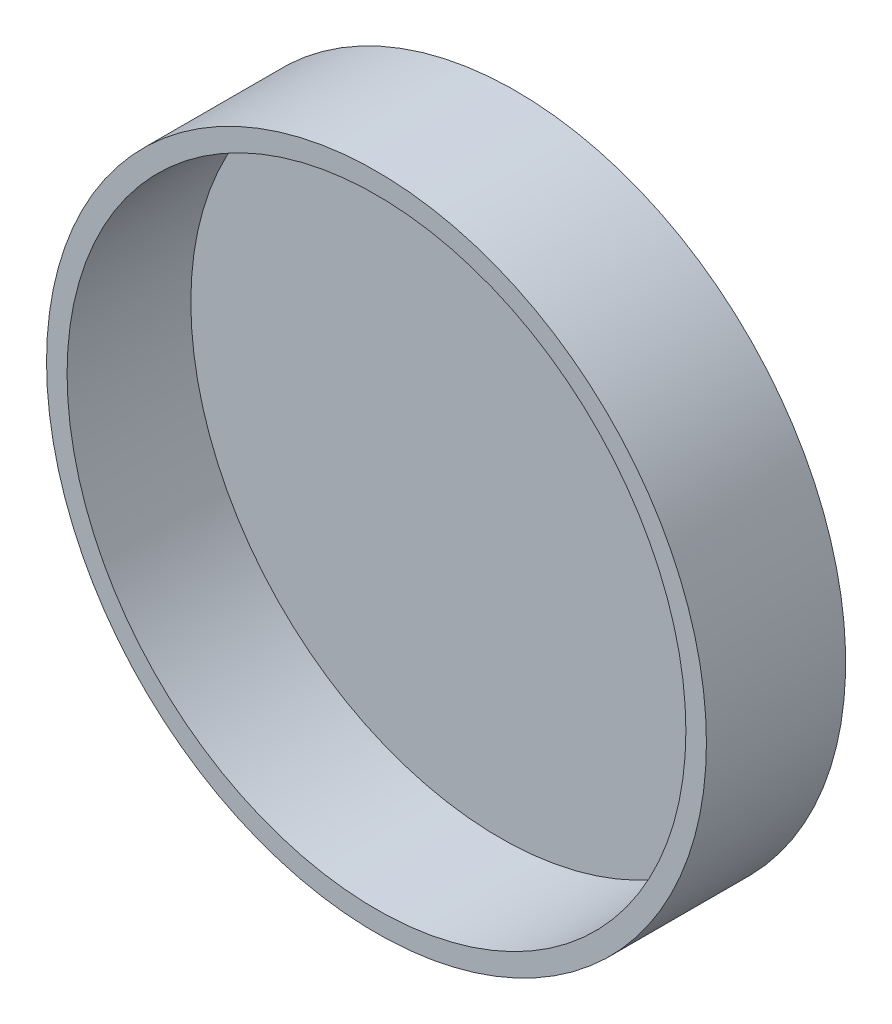
ISO-10303-21;
HEADER;
FILE_DESCRIPTION(('STEP AP214'),'2;1');
FILE_NAME('part.step','',(''),(''),'','','');
FILE_SCHEMA(('AUTOMOTIVE_DESIGN { 1 0 10303 214 1 1 1 1 }'));
ENDSEC;
DATA;
#1=APPLICATION_CONTEXT('core data for automotive mechanical design processes');
#2=APPLICATION_PROTOCOL_DEFINITION('international standard','automotive_design',2000,#1);
#3=PRODUCT_CONTEXT('',#1,'mechanical');
#4=PRODUCT('Part','Part','',(#3));
#5=PRODUCT_RELATED_PRODUCT_CATEGORY('part','',(#4));
#6=PRODUCT_DEFINITION_FORMATION('','',#4);
#7=PRODUCT_DEFINITION_CONTEXT('part definition',#1,'design');
#8=PRODUCT_DEFINITION('design','',#6,#7);
#9=PRODUCT_DEFINITION_SHAPE('','',#8);
#10=(LENGTH_UNIT() NAMED_UNIT(*) SI_UNIT(.MILLI.,.METRE.));
#11=(NAMED_UNIT(*) PLANE_ANGLE_UNIT() SI_UNIT($,.RADIAN.));
#12=(NAMED_UNIT(*) SI_UNIT($,.STERADIAN.) SOLID_ANGLE_UNIT());
#13=UNCERTAINTY_MEASURE_WITH_UNIT(LENGTH_MEASURE(1.E-05),#10,'distance_accuracy_value','');
#14=(GEOMETRIC_REPRESENTATION_CONTEXT(3) GLOBAL_UNCERTAINTY_ASSIGNED_CONTEXT((#13)) GLOBAL_UNIT_ASSIGNED_CONTEXT((#10,
#11,#12)) REPRESENTATION_CONTEXT('',''));
#15=CARTESIAN_POINT('',(0.,0.,0.));
#16=DIRECTION('',(0.,0.,1.));
#17=DIRECTION('',(1.,0.,0.));
#18=AXIS2_PLACEMENT_3D('',#15,#16,#17);
#19=CARTESIAN_POINT('',(-33.8331221152249,23.9224095764217,20.32));
#20=DIRECTION('',(0.,0.,1.));
#21=DIRECTION('',(1.,0.,0.));
#22=AXIS2_PLACEMENT_3D('',#19,#20,#21);
#23=PLANE('',#22);
#24=CARTESIAN_POINT('',(-33.8331221152249,23.9224095764217,20.32));
#25=DIRECTION('',(0.,0.,1.));
#26=DIRECTION('',(1.,0.,0.));
#27=AXIS2_PLACEMENT_3D('',#24,#25,#26);
#28=CIRCLE('',#27,54.1728897221778);
#29=CARTESIAN_POINT('',(20.3397676069528,23.9224095764217,20.32));
#30=VERTEX_POINT('',#29);
#31=EDGE_CURVE('E10',#30,#30,#28,.T.);
#32=ORIENTED_EDGE('',*,*,#31,.T.);
#33=EDGE_LOOP('',(#32));
#34=FACE_BOUND('',#33,.T.);
#35=CARTESIAN_POINT('',(-33.8331221152249,23.9224095764217,20.32));
#36=DIRECTION('',(0.,0.,1.));
#37=DIRECTION('',(1.,0.,0.));
#38=AXIS2_PLACEMENT_3D('',#35,#36,#37);
#39=CIRCLE('',#38,50.8);
#40=CARTESIAN_POINT('',(16.9668778847751,23.9224095764217,20.32));
#41=VERTEX_POINT('',#40);
#42=EDGE_CURVE('E45',#41,#41,#39,.T.);
#43=ORIENTED_EDGE('',*,*,#42,.F.);
#44=EDGE_LOOP('',(#43));
#45=FACE_BOUND('',#44,.T.);
#46=ADVANCED_FACE('F37',(#34,#45),#23,.T.);
#47=CARTESIAN_POINT('',(-33.8331221152249,23.9224095764217,20.32));
#48=DIRECTION('',(0.,0.,-1.));
#49=DIRECTION('',(-1.,0.,0.));
#50=AXIS2_PLACEMENT_3D('',#47,#48,#49);
#51=CYLINDRICAL_SURFACE('',#50,54.1728897221778);
#52=ORIENTED_EDGE('',*,*,#31,.F.);
#53=EDGE_LOOP('',(#52));
#54=FACE_BOUND('',#53,.T.);
#55=CARTESIAN_POINT('',(-33.8331221152249,23.9224095764217,-2.54));
#56=DIRECTION('',(0.,0.,-1.));
#57=DIRECTION('',(-1.,0.,0.));
#58=AXIS2_PLACEMENT_3D('',#55,#56,#57);
#59=CIRCLE('',#58,54.1728897221778);
#60=CARTESIAN_POINT('',(-88.0060118374027,23.9224095764217,-2.54));
#61=VERTEX_POINT('',#60);
#62=EDGE_CURVE('E56',#61,#61,#59,.T.);
#63=ORIENTED_EDGE('',*,*,#62,.F.);
#64=EDGE_LOOP('',(#63));
#65=FACE_BOUND('',#64,.T.);
#66=ADVANCED_FACE('F39',(#54,#65),#51,.T.);
#67=CARTESIAN_POINT('',(-33.8331221152249,23.9224095764217,20.32));
#68=DIRECTION('',(0.,0.,-1.));
#69=DIRECTION('',(-1.,0.,0.));
#70=AXIS2_PLACEMENT_3D('',#67,#68,#69);
#71=CYLINDRICAL_SURFACE('',#70,50.8);
#72=ORIENTED_EDGE('',*,*,#42,.T.);
#73=EDGE_LOOP('',(#72));
#74=FACE_BOUND('',#73,.T.);
#75=CARTESIAN_POINT('',(-33.8331221152249,23.9224095764217,0.));
#76=DIRECTION('',(0.,0.,1.));
#77=DIRECTION('',(1.,0.,0.));
#78=AXIS2_PLACEMENT_3D('',#75,#76,#77);
#79=CIRCLE('',#78,50.8);
#80=CARTESIAN_POINT('',(16.9668778847751,23.9224095764217,0.));
#81=VERTEX_POINT('',#80);
#82=EDGE_CURVE('E50',#81,#81,#79,.T.);
#83=ORIENTED_EDGE('',*,*,#82,.F.);
#84=EDGE_LOOP('',(#83));
#85=FACE_BOUND('',#84,.T.);
#86=ADVANCED_FACE('F65',(#74,#85),#71,.F.);
#87=CARTESIAN_POINT('',(-33.8331221152249,23.9224095764217,0.));
#88=DIRECTION('',(0.,0.,-1.));
#89=DIRECTION('',(-1.,0.,0.));
#90=AXIS2_PLACEMENT_3D('',#87,#88,#89);
#91=PLANE('',#90);
#92=ORIENTED_EDGE('',*,*,#82,.T.);
#93=EDGE_LOOP('',(#92));
#94=FACE_BOUND('',#93,.T.);
#95=ADVANCED_FACE('F71',(#94),#91,.F.);
#96=CARTESIAN_POINT('',(-33.8331221152249,23.9224095764217,-2.54));
#97=DIRECTION('',(0.,0.,-1.));
#98=DIRECTION('',(-1.,0.,0.));
#99=AXIS2_PLACEMENT_3D('',#96,#97,#98);
#100=PLANE('',#99);
#101=ORIENTED_EDGE('',*,*,#62,.T.);
#102=EDGE_LOOP('',(#101));
#103=FACE_BOUND('',#102,.T.);
#104=ADVANCED_FACE('F62',(#103),#100,.T.);
#105=CLOSED_SHELL('',(#46,#66,#86,#95,#104));
#106=MANIFOLD_SOLID_BREP('B2',#105);
#107=ADVANCED_BREP_SHAPE_REPRESENTATION('',(#18,#106),#14);
#108=SHAPE_DEFINITION_REPRESENTATION(#9,#107);
ENDSEC;
END-ISO-10303-21;
